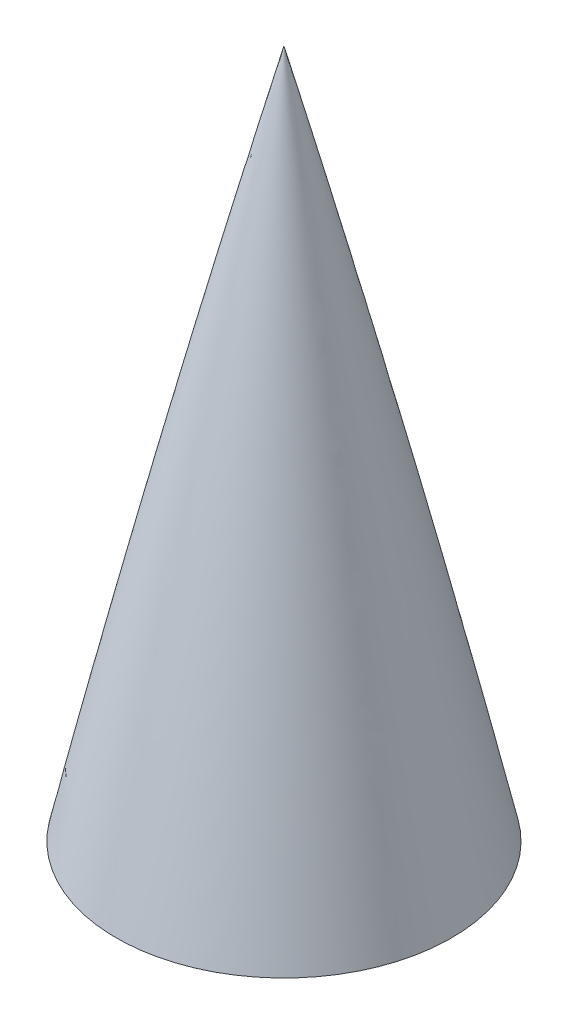
ISO-10303-21;
HEADER;
FILE_DESCRIPTION(('STEP AP214'),'2;1');
FILE_NAME('part.step','',(''),(''),'','','');
FILE_SCHEMA(('AUTOMOTIVE_DESIGN { 1 0 10303 214 1 1 1 1 }'));
ENDSEC;
DATA;
#1=APPLICATION_CONTEXT('core data for automotive mechanical design processes');
#2=APPLICATION_PROTOCOL_DEFINITION('international standard','automotive_design',2000,#1);
#3=PRODUCT_CONTEXT('',#1,'mechanical');
#4=PRODUCT('Part','Part','',(#3));
#5=PRODUCT_RELATED_PRODUCT_CATEGORY('part','',(#4));
#6=PRODUCT_DEFINITION_FORMATION('','',#4);
#7=PRODUCT_DEFINITION_CONTEXT('part definition',#1,'design');
#8=PRODUCT_DEFINITION('design','',#6,#7);
#9=PRODUCT_DEFINITION_SHAPE('','',#8);
#10=(LENGTH_UNIT() NAMED_UNIT(*) SI_UNIT(.MILLI.,.METRE.));
#11=(NAMED_UNIT(*) PLANE_ANGLE_UNIT() SI_UNIT($,.RADIAN.));
#12=(NAMED_UNIT(*) SI_UNIT($,.STERADIAN.) SOLID_ANGLE_UNIT());
#13=UNCERTAINTY_MEASURE_WITH_UNIT(LENGTH_MEASURE(1.E-05),#10,'distance_accuracy_value','');
#14=(GEOMETRIC_REPRESENTATION_CONTEXT(3) GLOBAL_UNCERTAINTY_ASSIGNED_CONTEXT((#13)) GLOBAL_UNIT_ASSIGNED_CONTEXT((#10,
#11,#12)) REPRESENTATION_CONTEXT('',''));
#15=CARTESIAN_POINT('',(0.,0.,0.));
#16=DIRECTION('',(0.,0.,1.));
#17=DIRECTION('',(1.,0.,0.));
#18=AXIS2_PLACEMENT_3D('',#15,#16,#17);
#19=CARTESIAN_POINT('',(0.,1.94289029309402E-13,0.));
#20=DIRECTION('',(0.,-1.,0.));
#21=DIRECTION('',(0.,0.,-1.));
#22=AXIS2_PLACEMENT_3D('',#19,#20,#21);
#23=PLANE('',#22);
#24=CARTESIAN_POINT('',(0.,3.88578058618805E-13,0.));
#25=DIRECTION('',(0.,-1.,0.));
#26=DIRECTION('',(0.,0.,-1.));
#27=AXIS2_PLACEMENT_3D('',#24,#25,#26);
#28=CIRCLE('',#27,18.5515487428514);
#29=CARTESIAN_POINT('',(0.,3.88578058618805E-13,-18.5515487428514));
#30=VERTEX_POINT('',#29);
#31=EDGE_CURVE('E11',#30,#30,#28,.T.);
#32=ORIENTED_EDGE('',*,*,#31,.T.);
#33=EDGE_LOOP('',(#32));
#34=FACE_BOUND('',#33,.T.);
#35=ADVANCED_FACE('F35',(#34),#23,.T.);
#36=CARTESIAN_POINT('',(0.,-431.8,1920.82615384615));
#37=DIRECTION('',(-1.,0.,0.));
#38=DIRECTION('',(0.,0.,-1.));
#39=AXIS2_PLACEMENT_3D('',#36,#37,#38);
#40=CIRCLE('',#39,1986.86615384615);
#41=TRIMMED_CURVE('',#40,(PARAMETER_VALUE(-0.258550008096286)),
(PARAMETER_VALUE(0.258550008096286)),.T.,.PARAMETER.);
#42=CARTESIAN_POINT('',(0.,-431.8,0.));
#43=DIRECTION('',(0.,-1.,0.));
#44=AXIS1_PLACEMENT('',#42,#43);
#45=SURFACE_OF_REVOLUTION('',#41,#44);
#46=CARTESIAN_POINT('',(0.,76.2,0.));
#47=VERTEX_POINT('',#46);
#48=VERTEX_LOOP('',#47);
#49=FACE_BOUND('',#48,.T.);
#50=ORIENTED_EDGE('',*,*,#31,.F.);
#51=EDGE_LOOP('',(#50));
#52=FACE_BOUND('',#51,.T.);
#53=ADVANCED_FACE('F42',(#49,#52),#45,.T.);
#54=CLOSED_SHELL('',(#35,#53));
#55=MANIFOLD_SOLID_BREP('B2',#54);
#56=ADVANCED_BREP_SHAPE_REPRESENTATION('',(#18,#55),#14);
#57=SHAPE_DEFINITION_REPRESENTATION(#9,#56);
ENDSEC;
END-ISO-10303-21;
